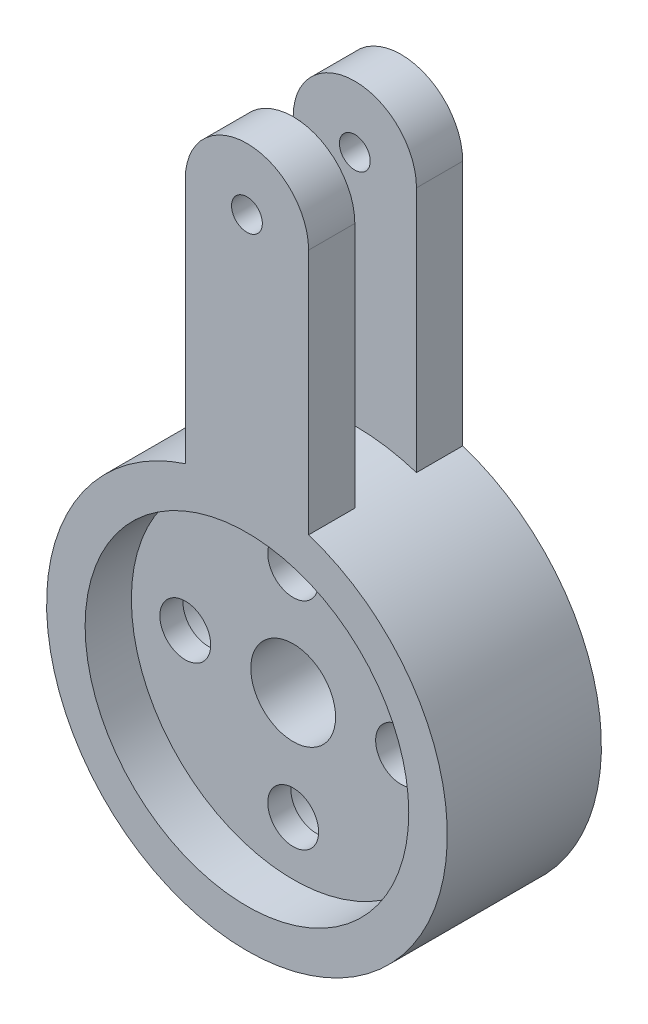
ISO-10303-21;
HEADER;
FILE_DESCRIPTION(('STEP AP214'),'2;1');
FILE_NAME('part.step','',(''),(''),'','','');
FILE_SCHEMA(('AUTOMOTIVE_DESIGN { 1 0 10303 214 1 1 1 1 }'));
ENDSEC;
DATA;
#1=APPLICATION_CONTEXT('core data for automotive mechanical design processes');
#2=APPLICATION_PROTOCOL_DEFINITION('international standard','automotive_design',2000,#1);
#3=PRODUCT_CONTEXT('',#1,'mechanical');
#4=PRODUCT('Part','Part','',(#3));
#5=PRODUCT_RELATED_PRODUCT_CATEGORY('part','',(#4));
#6=PRODUCT_DEFINITION_FORMATION('','',#4);
#7=PRODUCT_DEFINITION_CONTEXT('part definition',#1,'design');
#8=PRODUCT_DEFINITION('design','',#6,#7);
#9=PRODUCT_DEFINITION_SHAPE('','',#8);
#10=(LENGTH_UNIT() NAMED_UNIT(*) SI_UNIT(.MILLI.,.METRE.));
#11=(NAMED_UNIT(*) PLANE_ANGLE_UNIT() SI_UNIT($,.RADIAN.));
#12=(NAMED_UNIT(*) SI_UNIT($,.STERADIAN.) SOLID_ANGLE_UNIT());
#13=UNCERTAINTY_MEASURE_WITH_UNIT(LENGTH_MEASURE(1.E-05),#10,'distance_accuracy_value','');
#14=(GEOMETRIC_REPRESENTATION_CONTEXT(3) GLOBAL_UNCERTAINTY_ASSIGNED_CONTEXT((#13)) GLOBAL_UNIT_ASSIGNED_CONTEXT((#10,
#11,#12)) REPRESENTATION_CONTEXT('',''));
#15=CARTESIAN_POINT('',(0.,0.,0.));
#16=DIRECTION('',(0.,0.,1.));
#17=DIRECTION('',(1.,0.,0.));
#18=AXIS2_PLACEMENT_3D('',#15,#16,#17);
#19=CARTESIAN_POINT('',(0.,0.,10.));
#20=DIRECTION('',(0.,0.,-1.));
#21=DIRECTION('',(-1.,0.,0.));
#22=AXIS2_PLACEMENT_3D('',#19,#20,#21);
#23=CYLINDRICAL_SURFACE('',#22,13.);
#24=CARTESIAN_POINT('',(0.,0.,0.));
#25=DIRECTION('',(0.,0.,1.));
#26=DIRECTION('',(1.,0.,0.));
#27=AXIS2_PLACEMENT_3D('',#24,#25,#26);
#28=CIRCLE('',#27,13.);
#29=CARTESIAN_POINT('',(-4.,12.369316876853,0.));
#30=VERTEX_POINT('',#29);
#31=CARTESIAN_POINT('',(4.,12.369316876853,0.));
#32=VERTEX_POINT('',#31);
#33=EDGE_CURVE('E44',#30,#32,#28,.T.);
#34=ORIENTED_EDGE('',*,*,#33,.T.);
#35=DIRECTION('',(0.,0.,-1.));
#36=VECTOR('',#35,1.);
#37=CARTESIAN_POINT('',(4.,12.369316876853,3.));
#38=LINE('',#37,#36);
#39=CARTESIAN_POINT('',(4.,12.369316876853,3.));
#40=VERTEX_POINT('',#39);
#41=EDGE_CURVE('E153',#40,#32,#38,.T.);
#42=ORIENTED_EDGE('',*,*,#41,.F.);
#43=CARTESIAN_POINT('',(0.,-8.6389229103645E-13,3.));
#44=DIRECTION('',(0.,0.,1.));
#45=DIRECTION('',(1.,0.,0.));
#46=AXIS2_PLACEMENT_3D('',#43,#44,#45);
#47=CIRCLE('',#46,13.0000000000008);
#48=CARTESIAN_POINT('',(-4.,12.369316876853,3.));
#49=VERTEX_POINT('',#48);
#50=EDGE_CURVE('E133',#40,#49,#47,.T.);
#51=ORIENTED_EDGE('',*,*,#50,.T.);
#52=DIRECTION('',(0.,0.,-1.));
#53=VECTOR('',#52,1.);
#54=CARTESIAN_POINT('',(-4.,12.369316876853,3.));
#55=LINE('',#54,#53);
#56=EDGE_CURVE('E145',#49,#30,#55,.T.);
#57=ORIENTED_EDGE('',*,*,#56,.T.);
#58=EDGE_LOOP('',(#34,#42,#51,#57));
#59=FACE_BOUND('',#58,.T.);
#60=DIRECTION('',(0.,0.,1.));
#61=VECTOR('',#60,1.);
#62=CARTESIAN_POINT('',(-4.,12.369316876853,7.));
#63=LINE('',#62,#61);
#64=CARTESIAN_POINT('',(-4.,12.369316876853,7.));
#65=VERTEX_POINT('',#64);
#66=CARTESIAN_POINT('',(-4.,12.369316876853,10.));
#67=VERTEX_POINT('',#66);
#68=EDGE_CURVE('E52',#65,#67,#63,.T.);
#69=ORIENTED_EDGE('',*,*,#68,.F.);
#70=CARTESIAN_POINT('',(0.,-8.6389229103645E-13,7.));
#71=DIRECTION('',(0.,0.,1.));
#72=DIRECTION('',(1.,0.,0.));
#73=AXIS2_PLACEMENT_3D('',#70,#71,#72);
#74=CIRCLE('',#73,13.0000000000008);
#75=CARTESIAN_POINT('',(4.,12.369316876853,7.));
#76=VERTEX_POINT('',#75);
#77=EDGE_CURVE('E97',#76,#65,#74,.T.);
#78=ORIENTED_EDGE('',*,*,#77,.F.);
#79=DIRECTION('',(0.,0.,1.));
#80=VECTOR('',#79,1.);
#81=CARTESIAN_POINT('',(4.,12.369316876853,7.));
#82=LINE('',#81,#80);
#83=CARTESIAN_POINT('',(4.,12.369316876853,10.));
#84=VERTEX_POINT('',#83);
#85=EDGE_CURVE('E100',#76,#84,#82,.T.);
#86=ORIENTED_EDGE('',*,*,#85,.T.);
#87=CARTESIAN_POINT('',(0.,0.,10.));
#88=DIRECTION('',(0.,0.,1.));
#89=DIRECTION('',(1.,0.,0.));
#90=AXIS2_PLACEMENT_3D('',#87,#88,#89);
#91=CIRCLE('',#90,13.);
#92=EDGE_CURVE('E11',#67,#84,#91,.T.);
#93=ORIENTED_EDGE('',*,*,#92,.F.);
#94=EDGE_LOOP('',(#69,#78,#86,#93));
#95=FACE_BOUND('',#94,.T.);
#96=ADVANCED_FACE('F36',(#59,#95),#23,.T.);
#97=CARTESIAN_POINT('',(-7.,0.,10.));
#98=DIRECTION('',(0.,0.,-1.));
#99=DIRECTION('',(-1.,0.,0.));
#100=AXIS2_PLACEMENT_3D('',#97,#98,#99);
#101=CYLINDRICAL_SURFACE('',#100,1.65);
#102=CARTESIAN_POINT('',(-7.,0.,7.));
#103=DIRECTION('',(0.,0.,1.));
#104=DIRECTION('',(1.,0.,0.));
#105=AXIS2_PLACEMENT_3D('',#102,#103,#104);
#106=CIRCLE('',#105,1.65);
#107=CARTESIAN_POINT('',(-5.35,0.,7.));
#108=VERTEX_POINT('',#107);
#109=EDGE_CURVE('E200',#108,#108,#106,.T.);
#110=ORIENTED_EDGE('',*,*,#109,.T.);
#111=EDGE_LOOP('',(#110));
#112=FACE_BOUND('',#111,.T.);
#113=CARTESIAN_POINT('',(-7.,0.,5.5));
#114=DIRECTION('',(0.,0.,-1.));
#115=DIRECTION('',(-1.,0.,0.));
#116=AXIS2_PLACEMENT_3D('',#113,#114,#115);
#117=CIRCLE('',#116,1.65);
#118=CARTESIAN_POINT('',(-8.65,0.,5.5));
#119=VERTEX_POINT('',#118);
#120=EDGE_CURVE('E39',#119,#119,#117,.T.);
#121=ORIENTED_EDGE('',*,*,#120,.T.);
#122=EDGE_LOOP('',(#121));
#123=FACE_BOUND('',#122,.T.);
#124=ADVANCED_FACE('F223',(#112,#123),#101,.F.);
#125=CARTESIAN_POINT('',(0.,7.,10.));
#126=DIRECTION('',(0.,0.,-1.));
#127=DIRECTION('',(-1.,0.,0.));
#128=AXIS2_PLACEMENT_3D('',#125,#126,#127);
#129=CYLINDRICAL_SURFACE('',#128,1.65);
#130=CARTESIAN_POINT('',(0.,7.,7.));
#131=DIRECTION('',(0.,0.,1.));
#132=DIRECTION('',(1.,0.,0.));
#133=AXIS2_PLACEMENT_3D('',#130,#131,#132);
#134=CIRCLE('',#133,1.65);
#135=CARTESIAN_POINT('',(1.65000000000003,7.,7.));
#136=VERTEX_POINT('',#135);
#137=EDGE_CURVE('E197',#136,#136,#134,.T.);
#138=ORIENTED_EDGE('',*,*,#137,.T.);
#139=EDGE_LOOP('',(#138));
#140=FACE_BOUND('',#139,.T.);
#141=CARTESIAN_POINT('',(0.,7.,5.5));
#142=DIRECTION('',(0.,0.,-1.));
#143=DIRECTION('',(-1.,0.,0.));
#144=AXIS2_PLACEMENT_3D('',#141,#142,#143);
#145=CIRCLE('',#144,1.65);
#146=CARTESIAN_POINT('',(-1.64999999999998,7.,5.5));
#147=VERTEX_POINT('',#146);
#148=EDGE_CURVE('E216',#147,#147,#145,.T.);
#149=ORIENTED_EDGE('',*,*,#148,.T.);
#150=EDGE_LOOP('',(#149));
#151=FACE_BOUND('',#150,.T.);
#152=ADVANCED_FACE('F273',(#140,#151),#129,.F.);
#153=CARTESIAN_POINT('',(7.,0.,10.));
#154=DIRECTION('',(0.,0.,-1.));
#155=DIRECTION('',(-1.,0.,0.));
#156=AXIS2_PLACEMENT_3D('',#153,#154,#155);
#157=CYLINDRICAL_SURFACE('',#156,1.65);
#158=CARTESIAN_POINT('',(7.,0.,7.));
#159=DIRECTION('',(0.,0.,1.));
#160=DIRECTION('',(1.,0.,0.));
#161=AXIS2_PLACEMENT_3D('',#158,#159,#160);
#162=CIRCLE('',#161,1.65);
#163=CARTESIAN_POINT('',(8.65,0.,7.));
#164=VERTEX_POINT('',#163);
#165=EDGE_CURVE('E194',#164,#164,#162,.T.);
#166=ORIENTED_EDGE('',*,*,#165,.T.);
#167=EDGE_LOOP('',(#166));
#168=FACE_BOUND('',#167,.T.);
#169=CARTESIAN_POINT('',(7.,0.,5.5));
#170=DIRECTION('',(0.,0.,-1.));
#171=DIRECTION('',(-1.,0.,0.));
#172=AXIS2_PLACEMENT_3D('',#169,#170,#171);
#173=CIRCLE('',#172,1.65);
#174=CARTESIAN_POINT('',(5.35,0.,5.5));
#175=VERTEX_POINT('',#174);
#176=EDGE_CURVE('E214',#175,#175,#173,.T.);
#177=ORIENTED_EDGE('',*,*,#176,.T.);
#178=EDGE_LOOP('',(#177));
#179=FACE_BOUND('',#178,.T.);
#180=ADVANCED_FACE('F331',(#168,#179),#157,.F.);
#181=CARTESIAN_POINT('',(0.,-7.,10.));
#182=DIRECTION('',(0.,0.,-1.));
#183=DIRECTION('',(-1.,0.,0.));
#184=AXIS2_PLACEMENT_3D('',#181,#182,#183);
#185=CYLINDRICAL_SURFACE('',#184,1.65);
#186=CARTESIAN_POINT('',(0.,-7.,7.));
#187=DIRECTION('',(0.,0.,1.));
#188=DIRECTION('',(1.,0.,0.));
#189=AXIS2_PLACEMENT_3D('',#186,#187,#188);
#190=CIRCLE('',#189,1.65);
#191=CARTESIAN_POINT('',(1.64999999999993,-7.,7.));
#192=VERTEX_POINT('',#191);
#193=EDGE_CURVE('E190',#192,#192,#190,.T.);
#194=ORIENTED_EDGE('',*,*,#193,.T.);
#195=EDGE_LOOP('',(#194));
#196=FACE_BOUND('',#195,.T.);
#197=CARTESIAN_POINT('',(0.,-7.,5.5));
#198=DIRECTION('',(0.,0.,-1.));
#199=DIRECTION('',(-1.,0.,0.));
#200=AXIS2_PLACEMENT_3D('',#197,#198,#199);
#201=CIRCLE('',#200,1.65);
#202=CARTESIAN_POINT('',(-1.65000000000007,-7.,5.5));
#203=VERTEX_POINT('',#202);
#204=EDGE_CURVE('E166',#203,#203,#201,.T.);
#205=ORIENTED_EDGE('',*,*,#204,.T.);
#206=EDGE_LOOP('',(#205));
#207=FACE_BOUND('',#206,.T.);
#208=ADVANCED_FACE('F327',(#196,#207),#185,.F.);
#209=CARTESIAN_POINT('',(0.,0.,10.));
#210=DIRECTION('',(0.,0.,-1.));
#211=DIRECTION('',(-1.,0.,0.));
#212=AXIS2_PLACEMENT_3D('',#209,#210,#211);
#213=CYLINDRICAL_SURFACE('',#212,2.75);
#214=CARTESIAN_POINT('',(0.,0.,0.));
#215=DIRECTION('',(0.,0.,1.));
#216=DIRECTION('',(1.,0.,0.));
#217=AXIS2_PLACEMENT_3D('',#214,#215,#216);
#218=CIRCLE('',#217,2.75);
#219=CARTESIAN_POINT('',(2.75,0.,0.));
#220=VERTEX_POINT('',#219);
#221=EDGE_CURVE('E206',#220,#220,#218,.T.);
#222=ORIENTED_EDGE('',*,*,#221,.F.);
#223=EDGE_LOOP('',(#222));
#224=FACE_BOUND('',#223,.T.);
#225=CARTESIAN_POINT('',(0.,0.,7.));
#226=DIRECTION('',(0.,0.,1.));
#227=DIRECTION('',(1.,0.,0.));
#228=AXIS2_PLACEMENT_3D('',#225,#226,#227);
#229=CIRCLE('',#228,2.75);
#230=CARTESIAN_POINT('',(2.75,0.,7.));
#231=VERTEX_POINT('',#230);
#232=EDGE_CURVE('E203',#231,#231,#229,.T.);
#233=ORIENTED_EDGE('',*,*,#232,.T.);
#234=EDGE_LOOP('',(#233));
#235=FACE_BOUND('',#234,.T.);
#236=ADVANCED_FACE('F330',(#224,#235),#213,.F.);
#237=CARTESIAN_POINT('',(0.,0.,10.));
#238=DIRECTION('',(0.,0.,1.));
#239=DIRECTION('',(1.,0.,0.));
#240=AXIS2_PLACEMENT_3D('',#237,#238,#239);
#241=PLANE('',#240);
#242=CARTESIAN_POINT('',(0.,0.,10.));
#243=DIRECTION('',(0.,0.,1.));
#244=DIRECTION('',(1.,0.,0.));
#245=AXIS2_PLACEMENT_3D('',#242,#243,#244);
#246=CIRCLE('',#245,10.5);
#247=CARTESIAN_POINT('',(10.5,0.,10.));
#248=VERTEX_POINT('',#247);
#249=EDGE_CURVE('E191',#248,#248,#246,.T.);
#250=ORIENTED_EDGE('',*,*,#249,.F.);
#251=EDGE_LOOP('',(#250));
#252=FACE_BOUND('',#251,.T.);
#253=ORIENTED_EDGE('',*,*,#92,.T.);
#254=DIRECTION('',(0.,-1.,0.));
#255=VECTOR('',#254,1.);
#256=CARTESIAN_POINT('',(4.,28.369316876853,10.));
#257=LINE('',#256,#255);
#258=CARTESIAN_POINT('',(4.,28.369316876853,10.));
#259=VERTEX_POINT('',#258);
#260=EDGE_CURVE('E117',#259,#84,#257,.T.);
#261=ORIENTED_EDGE('',*,*,#260,.F.);
#262=CARTESIAN_POINT('',(0.,28.369316876853,10.));
#263=DIRECTION('',(0.,0.,-1.));
#264=DIRECTION('',(1.,0.,0.));
#265=AXIS2_PLACEMENT_3D('',#262,#263,#264);
#266=CIRCLE('',#265,4.);
#267=CARTESIAN_POINT('',(-4.,28.369316876853,10.));
#268=VERTEX_POINT('',#267);
#269=EDGE_CURVE('E360',#268,#259,#266,.T.);
#270=ORIENTED_EDGE('',*,*,#269,.F.);
#271=DIRECTION('',(0.,1.,0.));
#272=VECTOR('',#271,1.);
#273=CARTESIAN_POINT('',(-4.,28.369316876853,10.));
#274=LINE('',#273,#272);
#275=EDGE_CURVE('E103',#67,#268,#274,.T.);
#276=ORIENTED_EDGE('',*,*,#275,.F.);
#277=EDGE_LOOP('',(#253,#261,#270,#276));
#278=FACE_BOUND('',#277,.T.);
#279=CARTESIAN_POINT('',(0.,28.369316876853,10.));
#280=DIRECTION('',(0.,0.,-1.));
#281=DIRECTION('',(-1.,0.,0.));
#282=AXIS2_PLACEMENT_3D('',#279,#280,#281);
#283=CIRCLE('',#282,1.);
#284=CARTESIAN_POINT('',(-1.,28.369316876853,10.));
#285=VERTEX_POINT('',#284);
#286=EDGE_CURVE('E351',#285,#285,#283,.T.);
#287=ORIENTED_EDGE('',*,*,#286,.T.);
#288=EDGE_LOOP('',(#287));
#289=FACE_BOUND('',#288,.T.);
#290=ADVANCED_FACE('F243',(#252,#278,#289),#241,.T.);
#291=CARTESIAN_POINT('',(0.,0.,0.));
#292=DIRECTION('',(0.,0.,1.));
#293=DIRECTION('',(1.,0.,0.));
#294=AXIS2_PLACEMENT_3D('',#291,#292,#293);
#295=PLANE('',#294);
#296=CARTESIAN_POINT('',(7.,0.,0.));
#297=DIRECTION('',(0.,0.,-1.));
#298=DIRECTION('',(-1.,0.,0.));
#299=AXIS2_PLACEMENT_3D('',#296,#297,#298);
#300=CIRCLE('',#299,2.75);
#301=CARTESIAN_POINT('',(4.25,0.,0.));
#302=VERTEX_POINT('',#301);
#303=EDGE_CURVE('E167',#302,#302,#300,.T.);
#304=ORIENTED_EDGE('',*,*,#303,.F.);
#305=EDGE_LOOP('',(#304));
#306=FACE_BOUND('',#305,.T.);
#307=CARTESIAN_POINT('',(0.,7.,0.));
#308=DIRECTION('',(0.,0.,-1.));
#309=DIRECTION('',(-1.,0.,0.));
#310=AXIS2_PLACEMENT_3D('',#307,#308,#309);
#311=CIRCLE('',#310,2.75);
#312=CARTESIAN_POINT('',(-2.74999999999998,7.,0.));
#313=VERTEX_POINT('',#312);
#314=EDGE_CURVE('E170',#313,#313,#311,.T.);
#315=ORIENTED_EDGE('',*,*,#314,.F.);
#316=EDGE_LOOP('',(#315));
#317=FACE_BOUND('',#316,.T.);
#318=CARTESIAN_POINT('',(-7.,0.,0.));
#319=DIRECTION('',(0.,0.,-1.));
#320=DIRECTION('',(-1.,0.,0.));
#321=AXIS2_PLACEMENT_3D('',#318,#319,#320);
#322=CIRCLE('',#321,2.75);
#323=CARTESIAN_POINT('',(-9.75,0.,0.));
#324=VERTEX_POINT('',#323);
#325=EDGE_CURVE('E176',#324,#324,#322,.T.);
#326=ORIENTED_EDGE('',*,*,#325,.F.);
#327=EDGE_LOOP('',(#326));
#328=FACE_BOUND('',#327,.T.);
#329=CARTESIAN_POINT('',(0.,-7.,0.));
#330=DIRECTION('',(0.,0.,-1.));
#331=DIRECTION('',(-1.,0.,0.));
#332=AXIS2_PLACEMENT_3D('',#329,#330,#331);
#333=CIRCLE('',#332,2.75);
#334=CARTESIAN_POINT('',(-2.75000000000007,-7.,0.));
#335=VERTEX_POINT('',#334);
#336=EDGE_CURVE('E182',#335,#335,#333,.T.);
#337=ORIENTED_EDGE('',*,*,#336,.F.);
#338=EDGE_LOOP('',(#337));
#339=FACE_BOUND('',#338,.T.);
#340=ORIENTED_EDGE('',*,*,#33,.F.);
#341=DIRECTION('',(0.,1.,0.));
#342=VECTOR('',#341,1.);
#343=CARTESIAN_POINT('',(-4.,28.369316876853,0.));
#344=LINE('',#343,#342);
#345=CARTESIAN_POINT('',(-4.,28.369316876853,0.));
#346=VERTEX_POINT('',#345);
#347=EDGE_CURVE('E129',#30,#346,#344,.T.);
#348=ORIENTED_EDGE('',*,*,#347,.T.);
#349=CARTESIAN_POINT('',(0.,28.369316876853,0.));
#350=DIRECTION('',(0.,0.,-1.));
#351=DIRECTION('',(1.,0.,0.));
#352=AXIS2_PLACEMENT_3D('',#349,#350,#351);
#353=CIRCLE('',#352,4.);
#354=CARTESIAN_POINT('',(4.,28.369316876853,0.));
#355=VERTEX_POINT('',#354);
#356=EDGE_CURVE('E148',#346,#355,#353,.T.);
#357=ORIENTED_EDGE('',*,*,#356,.T.);
#358=DIRECTION('',(0.,-1.,0.));
#359=VECTOR('',#358,1.);
#360=CARTESIAN_POINT('',(4.,28.369316876853,0.));
#361=LINE('',#360,#359);
#362=EDGE_CURVE('E136',#355,#32,#361,.T.);
#363=ORIENTED_EDGE('',*,*,#362,.T.);
#364=EDGE_LOOP('',(#340,#348,#357,#363));
#365=FACE_BOUND('',#364,.T.);
#366=ORIENTED_EDGE('',*,*,#221,.T.);
#367=EDGE_LOOP('',(#366));
#368=FACE_BOUND('',#367,.T.);
#369=CARTESIAN_POINT('',(0.,28.369316876853,0.));
#370=DIRECTION('',(0.,0.,-1.));
#371=DIRECTION('',(-1.,0.,0.));
#372=AXIS2_PLACEMENT_3D('',#369,#370,#371);
#373=CIRCLE('',#372,1.);
#374=CARTESIAN_POINT('',(-1.,28.369316876853,0.));
#375=VERTEX_POINT('',#374);
#376=EDGE_CURVE('E130',#375,#375,#373,.T.);
#377=ORIENTED_EDGE('',*,*,#376,.F.);
#378=EDGE_LOOP('',(#377));
#379=FACE_BOUND('',#378,.T.);
#380=ADVANCED_FACE('F239',(#306,#317,#328,#339,#365,#368,#379),#295,.F.);
#381=CARTESIAN_POINT('',(0.,0.,7.));
#382=DIRECTION('',(0.,0.,1.));
#383=DIRECTION('',(1.,0.,0.));
#384=AXIS2_PLACEMENT_3D('',#381,#382,#383);
#385=CYLINDRICAL_SURFACE('',#384,10.5);
#386=CARTESIAN_POINT('',(0.,0.,7.));
#387=DIRECTION('',(0.,0.,1.));
#388=DIRECTION('',(1.,0.,0.));
#389=AXIS2_PLACEMENT_3D('',#386,#387,#388);
#390=CIRCLE('',#389,10.5);
#391=CARTESIAN_POINT('',(10.5,0.,7.));
#392=VERTEX_POINT('',#391);
#393=EDGE_CURVE('E187',#392,#392,#390,.T.);
#394=ORIENTED_EDGE('',*,*,#393,.F.);
#395=EDGE_LOOP('',(#394));
#396=FACE_BOUND('',#395,.T.);
#397=ORIENTED_EDGE('',*,*,#249,.T.);
#398=EDGE_LOOP('',(#397));
#399=FACE_BOUND('',#398,.T.);
#400=ADVANCED_FACE('F242',(#396,#399),#385,.F.);
#401=CARTESIAN_POINT('',(0.,0.,7.));
#402=DIRECTION('',(0.,0.,1.));
#403=DIRECTION('',(1.,0.,0.));
#404=AXIS2_PLACEMENT_3D('',#401,#402,#403);
#405=PLANE('',#404);
#406=ORIENTED_EDGE('',*,*,#232,.F.);
#407=EDGE_LOOP('',(#406));
#408=FACE_BOUND('',#407,.T.);
#409=ORIENTED_EDGE('',*,*,#109,.F.);
#410=EDGE_LOOP('',(#409));
#411=FACE_BOUND('',#410,.T.);
#412=ORIENTED_EDGE('',*,*,#137,.F.);
#413=EDGE_LOOP('',(#412));
#414=FACE_BOUND('',#413,.T.);
#415=ORIENTED_EDGE('',*,*,#165,.F.);
#416=EDGE_LOOP('',(#415));
#417=FACE_BOUND('',#416,.T.);
#418=ORIENTED_EDGE('',*,*,#193,.F.);
#419=EDGE_LOOP('',(#418));
#420=FACE_BOUND('',#419,.T.);
#421=ORIENTED_EDGE('',*,*,#393,.T.);
#422=EDGE_LOOP('',(#421));
#423=FACE_BOUND('',#422,.T.);
#424=ADVANCED_FACE('F316',(#408,#411,#414,#417,#420,#423),#405,.T.);
#425=CARTESIAN_POINT('',(0.,-7.,5.5));
#426=DIRECTION('',(0.,0.,-1.));
#427=DIRECTION('',(-1.,0.,0.));
#428=AXIS2_PLACEMENT_3D('',#425,#426,#427);
#429=CYLINDRICAL_SURFACE('',#428,2.75);
#430=CARTESIAN_POINT('',(0.,-7.,5.5));
#431=DIRECTION('',(0.,0.,-1.));
#432=DIRECTION('',(-1.,0.,0.));
#433=AXIS2_PLACEMENT_3D('',#430,#431,#432);
#434=CIRCLE('',#433,2.75);
#435=CARTESIAN_POINT('',(-2.75000000000007,-7.,5.5));
#436=VERTEX_POINT('',#435);
#437=EDGE_CURVE('E156',#436,#436,#434,.T.);
#438=ORIENTED_EDGE('',*,*,#437,.F.);
#439=EDGE_LOOP('',(#438));
#440=FACE_BOUND('',#439,.T.);
#441=ORIENTED_EDGE('',*,*,#336,.T.);
#442=EDGE_LOOP('',(#441));
#443=FACE_BOUND('',#442,.T.);
#444=ADVANCED_FACE('F313',(#440,#443),#429,.F.);
#445=CARTESIAN_POINT('',(0.,-7.,5.5));
#446=DIRECTION('',(0.,0.,-1.));
#447=DIRECTION('',(-1.,0.,0.));
#448=AXIS2_PLACEMENT_3D('',#445,#446,#447);
#449=PLANE('',#448);
#450=ORIENTED_EDGE('',*,*,#204,.F.);
#451=EDGE_LOOP('',(#450));
#452=FACE_BOUND('',#451,.T.);
#453=ORIENTED_EDGE('',*,*,#437,.T.);
#454=EDGE_LOOP('',(#453));
#455=FACE_BOUND('',#454,.T.);
#456=ADVANCED_FACE('F235',(#452,#455),#449,.T.);
#457=CARTESIAN_POINT('',(-7.,0.,5.5));
#458=DIRECTION('',(0.,0.,-1.));
#459=DIRECTION('',(-1.,0.,0.));
#460=AXIS2_PLACEMENT_3D('',#457,#458,#459);
#461=CYLINDRICAL_SURFACE('',#460,2.75);
#462=CARTESIAN_POINT('',(-7.,0.,5.5));
#463=DIRECTION('',(0.,0.,-1.));
#464=DIRECTION('',(-1.,0.,0.));
#465=AXIS2_PLACEMENT_3D('',#462,#463,#464);
#466=CIRCLE('',#465,2.75);
#467=CARTESIAN_POINT('',(-9.75,0.,5.5));
#468=VERTEX_POINT('',#467);
#469=EDGE_CURVE('E179',#468,#468,#466,.T.);
#470=ORIENTED_EDGE('',*,*,#469,.F.);
#471=EDGE_LOOP('',(#470));
#472=FACE_BOUND('',#471,.T.);
#473=ORIENTED_EDGE('',*,*,#325,.T.);
#474=EDGE_LOOP('',(#473));
#475=FACE_BOUND('',#474,.T.);
#476=ADVANCED_FACE('F229',(#472,#475),#461,.F.);
#477=CARTESIAN_POINT('',(-7.,0.,5.5));
#478=DIRECTION('',(0.,0.,-1.));
#479=DIRECTION('',(-1.,0.,0.));
#480=AXIS2_PLACEMENT_3D('',#477,#478,#479);
#481=PLANE('',#480);
#482=ORIENTED_EDGE('',*,*,#120,.F.);
#483=EDGE_LOOP('',(#482));
#484=FACE_BOUND('',#483,.T.);
#485=ORIENTED_EDGE('',*,*,#469,.T.);
#486=EDGE_LOOP('',(#485));
#487=FACE_BOUND('',#486,.T.);
#488=ADVANCED_FACE('F225',(#484,#487),#481,.T.);
#489=CARTESIAN_POINT('',(0.,7.,5.5));
#490=DIRECTION('',(0.,0.,-1.));
#491=DIRECTION('',(-1.,0.,0.));
#492=AXIS2_PLACEMENT_3D('',#489,#490,#491);
#493=CYLINDRICAL_SURFACE('',#492,2.75);
#494=CARTESIAN_POINT('',(0.,7.,5.5));
#495=DIRECTION('',(0.,0.,-1.));
#496=DIRECTION('',(-1.,0.,0.));
#497=AXIS2_PLACEMENT_3D('',#494,#495,#496);
#498=CIRCLE('',#497,2.75);
#499=CARTESIAN_POINT('',(-2.74999999999998,7.,5.5));
#500=VERTEX_POINT('',#499);
#501=EDGE_CURVE('E173',#500,#500,#498,.T.);
#502=ORIENTED_EDGE('',*,*,#501,.F.);
#503=EDGE_LOOP('',(#502));
#504=FACE_BOUND('',#503,.T.);
#505=ORIENTED_EDGE('',*,*,#314,.T.);
#506=EDGE_LOOP('',(#505));
#507=FACE_BOUND('',#506,.T.);
#508=ADVANCED_FACE('F228',(#504,#507),#493,.F.);
#509=CARTESIAN_POINT('',(0.,7.,5.5));
#510=DIRECTION('',(0.,0.,-1.));
#511=DIRECTION('',(-1.,0.,0.));
#512=AXIS2_PLACEMENT_3D('',#509,#510,#511);
#513=PLANE('',#512);
#514=ORIENTED_EDGE('',*,*,#148,.F.);
#515=EDGE_LOOP('',(#514));
#516=FACE_BOUND('',#515,.T.);
#517=ORIENTED_EDGE('',*,*,#501,.T.);
#518=EDGE_LOOP('',(#517));
#519=FACE_BOUND('',#518,.T.);
#520=ADVANCED_FACE('F305',(#516,#519),#513,.T.);
#521=CARTESIAN_POINT('',(7.,0.,5.5));
#522=DIRECTION('',(0.,0.,-1.));
#523=DIRECTION('',(-1.,0.,0.));
#524=AXIS2_PLACEMENT_3D('',#521,#522,#523);
#525=CYLINDRICAL_SURFACE('',#524,2.75);
#526=CARTESIAN_POINT('',(7.,0.,5.5));
#527=DIRECTION('',(0.,0.,-1.));
#528=DIRECTION('',(-1.,0.,0.));
#529=AXIS2_PLACEMENT_3D('',#526,#527,#528);
#530=CIRCLE('',#529,2.75);
#531=CARTESIAN_POINT('',(4.25,0.,5.5));
#532=VERTEX_POINT('',#531);
#533=EDGE_CURVE('E163',#532,#532,#530,.T.);
#534=ORIENTED_EDGE('',*,*,#533,.F.);
#535=EDGE_LOOP('',(#534));
#536=FACE_BOUND('',#535,.T.);
#537=ORIENTED_EDGE('',*,*,#303,.T.);
#538=EDGE_LOOP('',(#537));
#539=FACE_BOUND('',#538,.T.);
#540=ADVANCED_FACE('F301',(#536,#539),#525,.F.);
#541=CARTESIAN_POINT('',(7.,0.,5.5));
#542=DIRECTION('',(0.,0.,-1.));
#543=DIRECTION('',(-1.,0.,0.));
#544=AXIS2_PLACEMENT_3D('',#541,#542,#543);
#545=PLANE('',#544);
#546=ORIENTED_EDGE('',*,*,#176,.F.);
#547=EDGE_LOOP('',(#546));
#548=FACE_BOUND('',#547,.T.);
#549=ORIENTED_EDGE('',*,*,#533,.T.);
#550=EDGE_LOOP('',(#549));
#551=FACE_BOUND('',#550,.T.);
#552=ADVANCED_FACE('F298',(#548,#551),#545,.T.);
#553=CARTESIAN_POINT('',(4.,28.369316876853,3.));
#554=DIRECTION('',(1.,0.,0.));
#555=DIRECTION('',(0.,0.,-1.));
#556=AXIS2_PLACEMENT_3D('',#553,#554,#555);
#557=PLANE('',#556);
#558=ORIENTED_EDGE('',*,*,#362,.F.);
#559=DIRECTION('',(0.,0.,-1.));
#560=VECTOR('',#559,1.);
#561=CARTESIAN_POINT('',(4.,28.369316876853,3.));
#562=LINE('',#561,#560);
#563=CARTESIAN_POINT('',(4.,28.369316876853,3.));
#564=VERTEX_POINT('',#563);
#565=EDGE_CURVE('E157',#564,#355,#562,.T.);
#566=ORIENTED_EDGE('',*,*,#565,.F.);
#567=DIRECTION('',(0.,-1.,0.));
#568=VECTOR('',#567,1.);
#569=CARTESIAN_POINT('',(4.,28.369316876853,3.));
#570=LINE('',#569,#568);
#571=EDGE_CURVE('E142',#564,#40,#570,.T.);
#572=ORIENTED_EDGE('',*,*,#571,.T.);
#573=ORIENTED_EDGE('',*,*,#41,.T.);
#574=EDGE_LOOP('',(#558,#566,#572,#573));
#575=FACE_BOUND('',#574,.T.);
#576=ADVANCED_FACE('F281',(#575),#557,.T.);
#577=CARTESIAN_POINT('',(0.,28.369316876853,3.));
#578=DIRECTION('',(0.,0.,-1.));
#579=DIRECTION('',(-1.,0.,0.));
#580=AXIS2_PLACEMENT_3D('',#577,#578,#579);
#581=CYLINDRICAL_SURFACE('',#580,4.);
#582=ORIENTED_EDGE('',*,*,#356,.F.);
#583=DIRECTION('',(0.,0.,-1.));
#584=VECTOR('',#583,1.);
#585=CARTESIAN_POINT('',(-4.,28.369316876853,3.));
#586=LINE('',#585,#584);
#587=CARTESIAN_POINT('',(-4.,28.369316876853,3.));
#588=VERTEX_POINT('',#587);
#589=EDGE_CURVE('E159',#588,#346,#586,.T.);
#590=ORIENTED_EDGE('',*,*,#589,.F.);
#591=CARTESIAN_POINT('',(0.,28.369316876853,3.));
#592=DIRECTION('',(0.,0.,-1.));
#593=DIRECTION('',(1.,0.,0.));
#594=AXIS2_PLACEMENT_3D('',#591,#592,#593);
#595=CIRCLE('',#594,4.);
#596=EDGE_CURVE('E139',#588,#564,#595,.T.);
#597=ORIENTED_EDGE('',*,*,#596,.T.);
#598=ORIENTED_EDGE('',*,*,#565,.T.);
#599=EDGE_LOOP('',(#582,#590,#597,#598));
#600=FACE_BOUND('',#599,.T.);
#601=ADVANCED_FACE('F285',(#600),#581,.T.);
#602=CARTESIAN_POINT('',(-4.,28.369316876853,3.));
#603=DIRECTION('',(-1.,0.,0.));
#604=DIRECTION('',(0.,0.,1.));
#605=AXIS2_PLACEMENT_3D('',#602,#603,#604);
#606=PLANE('',#605);
#607=ORIENTED_EDGE('',*,*,#347,.F.);
#608=ORIENTED_EDGE('',*,*,#56,.F.);
#609=DIRECTION('',(0.,1.,0.));
#610=VECTOR('',#609,1.);
#611=CARTESIAN_POINT('',(-4.,28.369316876853,3.));
#612=LINE('',#611,#610);
#613=EDGE_CURVE('E135',#49,#588,#612,.T.);
#614=ORIENTED_EDGE('',*,*,#613,.T.);
#615=ORIENTED_EDGE('',*,*,#589,.T.);
#616=EDGE_LOOP('',(#607,#608,#614,#615));
#617=FACE_BOUND('',#616,.T.);
#618=ADVANCED_FACE('F263',(#617),#606,.T.);
#619=CARTESIAN_POINT('',(0.,-8.6389229103645E-13,3.));
#620=DIRECTION('',(0.,0.,1.));
#621=DIRECTION('',(1.,0.,0.));
#622=AXIS2_PLACEMENT_3D('',#619,#620,#621);
#623=PLANE('',#622);
#624=CARTESIAN_POINT('',(0.,28.369316876853,3.));
#625=DIRECTION('',(0.,0.,-1.));
#626=DIRECTION('',(-1.,0.,0.));
#627=AXIS2_PLACEMENT_3D('',#624,#625,#626);
#628=CIRCLE('',#627,1.);
#629=CARTESIAN_POINT('',(-1.,28.369316876853,3.));
#630=VERTEX_POINT('',#629);
#631=EDGE_CURVE('E126',#630,#630,#628,.T.);
#632=ORIENTED_EDGE('',*,*,#631,.T.);
#633=EDGE_LOOP('',(#632));
#634=FACE_BOUND('',#633,.T.);
#635=ORIENTED_EDGE('',*,*,#50,.F.);
#636=ORIENTED_EDGE('',*,*,#571,.F.);
#637=ORIENTED_EDGE('',*,*,#596,.F.);
#638=ORIENTED_EDGE('',*,*,#613,.F.);
#639=EDGE_LOOP('',(#635,#636,#637,#638));
#640=FACE_BOUND('',#639,.T.);
#641=ADVANCED_FACE('F254',(#634,#640),#623,.T.);
#642=CARTESIAN_POINT('',(0.,28.369316876853,3.));
#643=DIRECTION('',(0.,0.,-1.));
#644=DIRECTION('',(-1.,0.,0.));
#645=AXIS2_PLACEMENT_3D('',#642,#643,#644);
#646=CYLINDRICAL_SURFACE('',#645,1.);
#647=ORIENTED_EDGE('',*,*,#631,.F.);
#648=EDGE_LOOP('',(#647));
#649=FACE_BOUND('',#648,.T.);
#650=ORIENTED_EDGE('',*,*,#376,.T.);
#651=EDGE_LOOP('',(#650));
#652=FACE_BOUND('',#651,.T.);
#653=ADVANCED_FACE('F252',(#649,#652),#646,.F.);
#654=CARTESIAN_POINT('',(0.,-8.6389229103645E-13,7.));
#655=DIRECTION('',(0.,0.,-1.));
#656=DIRECTION('',(1.,0.,0.));
#657=AXIS2_PLACEMENT_3D('',#654,#655,#656);
#658=PLANE('',#657);
#659=ORIENTED_EDGE('',*,*,#77,.T.);
#660=DIRECTION('',(0.,1.,0.));
#661=VECTOR('',#660,1.);
#662=CARTESIAN_POINT('',(-4.,28.369316876853,7.));
#663=LINE('',#662,#661);
#664=CARTESIAN_POINT('',(-4.,28.369316876853,7.));
#665=VERTEX_POINT('',#664);
#666=EDGE_CURVE('E119',#65,#665,#663,.T.);
#667=ORIENTED_EDGE('',*,*,#666,.T.);
#668=CARTESIAN_POINT('',(0.,28.369316876853,7.));
#669=DIRECTION('',(0.,0.,-1.));
#670=DIRECTION('',(1.,0.,0.));
#671=AXIS2_PLACEMENT_3D('',#668,#669,#670);
#672=CIRCLE('',#671,4.);
#673=CARTESIAN_POINT('',(4.,28.369316876853,7.));
#674=VERTEX_POINT('',#673);
#675=EDGE_CURVE('E109',#665,#674,#672,.T.);
#676=ORIENTED_EDGE('',*,*,#675,.T.);
#677=DIRECTION('',(0.,-1.,0.));
#678=VECTOR('',#677,1.);
#679=CARTESIAN_POINT('',(4.,28.369316876853,7.));
#680=LINE('',#679,#678);
#681=EDGE_CURVE('E102',#674,#76,#680,.T.);
#682=ORIENTED_EDGE('',*,*,#681,.T.);
#683=EDGE_LOOP('',(#659,#667,#676,#682));
#684=FACE_BOUND('',#683,.T.);
#685=CARTESIAN_POINT('',(0.,28.369316876853,7.));
#686=DIRECTION('',(0.,0.,-1.));
#687=DIRECTION('',(-1.,0.,0.));
#688=AXIS2_PLACEMENT_3D('',#685,#686,#687);
#689=CIRCLE('',#688,1.);
#690=CARTESIAN_POINT('',(-1.,28.369316876853,7.));
#691=VERTEX_POINT('',#690);
#692=EDGE_CURVE('E353',#691,#691,#689,.T.);
#693=ORIENTED_EDGE('',*,*,#692,.F.);
#694=EDGE_LOOP('',(#693));
#695=FACE_BOUND('',#694,.T.);
#696=ADVANCED_FACE('F106',(#684,#695),#658,.T.);
#697=CARTESIAN_POINT('',(-4.,28.369316876853,7.));
#698=DIRECTION('',(1.,0.,0.));
#699=DIRECTION('',(0.,0.,-1.));
#700=AXIS2_PLACEMENT_3D('',#697,#698,#699);
#701=PLANE('',#700);
#702=ORIENTED_EDGE('',*,*,#275,.T.);
#703=DIRECTION('',(0.,0.,1.));
#704=VECTOR('',#703,1.);
#705=CARTESIAN_POINT('',(-4.,28.369316876853,7.));
#706=LINE('',#705,#704);
#707=EDGE_CURVE('E121',#665,#268,#706,.T.);
#708=ORIENTED_EDGE('',*,*,#707,.F.);
#709=ORIENTED_EDGE('',*,*,#666,.F.);
#710=ORIENTED_EDGE('',*,*,#68,.T.);
#711=EDGE_LOOP('',(#702,#708,#709,#710));
#712=FACE_BOUND('',#711,.T.);
#713=ADVANCED_FACE('F261',(#712),#701,.F.);
#714=CARTESIAN_POINT('',(0.,28.369316876853,7.));
#715=DIRECTION('',(0.,0.,1.));
#716=DIRECTION('',(1.,0.,0.));
#717=AXIS2_PLACEMENT_3D('',#714,#715,#716);
#718=CYLINDRICAL_SURFACE('',#717,4.);
#719=ORIENTED_EDGE('',*,*,#269,.T.);
#720=DIRECTION('',(0.,0.,1.));
#721=VECTOR('',#720,1.);
#722=CARTESIAN_POINT('',(4.,28.369316876853,7.));
#723=LINE('',#722,#721);
#724=EDGE_CURVE('E118',#674,#259,#723,.T.);
#725=ORIENTED_EDGE('',*,*,#724,.F.);
#726=ORIENTED_EDGE('',*,*,#675,.F.);
#727=ORIENTED_EDGE('',*,*,#707,.T.);
#728=EDGE_LOOP('',(#719,#725,#726,#727));
#729=FACE_BOUND('',#728,.T.);
#730=ADVANCED_FACE('F367',(#729),#718,.T.);
#731=CARTESIAN_POINT('',(4.,28.369316876853,7.));
#732=DIRECTION('',(-1.,0.,0.));
#733=DIRECTION('',(0.,0.,1.));
#734=AXIS2_PLACEMENT_3D('',#731,#732,#733);
#735=PLANE('',#734);
#736=ORIENTED_EDGE('',*,*,#260,.T.);
#737=ORIENTED_EDGE('',*,*,#85,.F.);
#738=ORIENTED_EDGE('',*,*,#681,.F.);
#739=ORIENTED_EDGE('',*,*,#724,.T.);
#740=EDGE_LOOP('',(#736,#737,#738,#739));
#741=FACE_BOUND('',#740,.T.);
#742=ADVANCED_FACE('F115',(#741),#735,.F.);
#743=CARTESIAN_POINT('',(0.,28.369316876853,7.));
#744=DIRECTION('',(0.,0.,1.));
#745=DIRECTION('',(1.,0.,0.));
#746=AXIS2_PLACEMENT_3D('',#743,#744,#745);
#747=CYLINDRICAL_SURFACE('',#746,1.);
#748=ORIENTED_EDGE('',*,*,#692,.T.);
#749=EDGE_LOOP('',(#748));
#750=FACE_BOUND('',#749,.T.);
#751=ORIENTED_EDGE('',*,*,#286,.F.);
#752=EDGE_LOOP('',(#751));
#753=FACE_BOUND('',#752,.T.);
#754=ADVANCED_FACE('F377',(#750,#753),#747,.F.);
#755=CLOSED_SHELL('',(#96,#124,#152,#180,#208,#236,#290,#380,#400,#424,#444,#456,#476,#488,#508,
#520,#540,#552,#576,#601,#618,#641,#653,#696,#713,#730,#742,#754));
#756=MANIFOLD_SOLID_BREP('B2',#755);
#757=ADVANCED_BREP_SHAPE_REPRESENTATION('',(#18,#756),#14);
#758=SHAPE_DEFINITION_REPRESENTATION(#9,#757);
ENDSEC;
END-ISO-10303-21;
